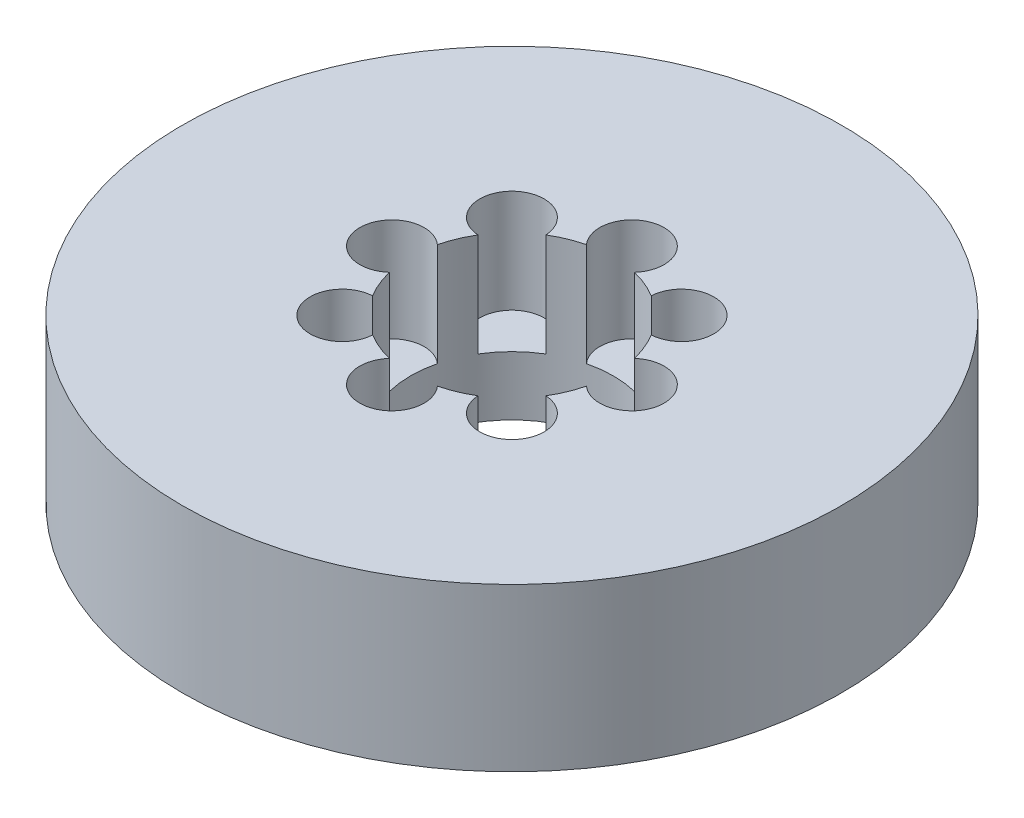
ISO-10303-21;
HEADER;
FILE_DESCRIPTION(('STEP AP214'),'2;1');
FILE_NAME('part.step','',(''),(''),'','','');
FILE_SCHEMA(('AUTOMOTIVE_DESIGN { 1 0 10303 214 1 1 1 1 }'));
ENDSEC;
DATA;
#1=APPLICATION_CONTEXT('core data for automotive mechanical design processes');
#2=APPLICATION_PROTOCOL_DEFINITION('international standard','automotive_design',2000,#1);
#3=PRODUCT_CONTEXT('',#1,'mechanical');
#4=PRODUCT('Part','Part','',(#3));
#5=PRODUCT_RELATED_PRODUCT_CATEGORY('part','',(#4));
#6=PRODUCT_DEFINITION_FORMATION('','',#4);
#7=PRODUCT_DEFINITION_CONTEXT('part definition',#1,'design');
#8=PRODUCT_DEFINITION('design','',#6,#7);
#9=PRODUCT_DEFINITION_SHAPE('','',#8);
#10=(LENGTH_UNIT() NAMED_UNIT(*) SI_UNIT(.MILLI.,.METRE.));
#11=(NAMED_UNIT(*) PLANE_ANGLE_UNIT() SI_UNIT($,.RADIAN.));
#12=(NAMED_UNIT(*) SI_UNIT($,.STERADIAN.) SOLID_ANGLE_UNIT());
#13=UNCERTAINTY_MEASURE_WITH_UNIT(LENGTH_MEASURE(1.E-05),#10,'distance_accuracy_value','');
#14=(GEOMETRIC_REPRESENTATION_CONTEXT(3) GLOBAL_UNCERTAINTY_ASSIGNED_CONTEXT((#13)) GLOBAL_UNIT_ASSIGNED_CONTEXT((#10,
#11,#12)) REPRESENTATION_CONTEXT('',''));
#15=CARTESIAN_POINT('',(0.,0.,0.));
#16=DIRECTION('',(0.,0.,1.));
#17=DIRECTION('',(1.,0.,0.));
#18=AXIS2_PLACEMENT_3D('',#15,#16,#17);
#19=CARTESIAN_POINT('',(0.,16.,0.));
#20=DIRECTION('',(0.,-1.,0.));
#21=DIRECTION('',(0.,0.,-1.));
#22=AXIS2_PLACEMENT_3D('',#19,#20,#21);
#23=CYLINDRICAL_SURFACE('',#22,32.5);
#24=CARTESIAN_POINT('',(0.,16.,0.));
#25=DIRECTION('',(0.,1.,0.));
#26=DIRECTION('',(0.,0.,1.));
#27=AXIS2_PLACEMENT_3D('',#24,#25,#26);
#28=CIRCLE('',#27,32.5);
#29=CARTESIAN_POINT('',(0.,16.,32.5));
#30=VERTEX_POINT('',#29);
#31=EDGE_CURVE('E195',#30,#30,#28,.T.);
#32=ORIENTED_EDGE('',*,*,#31,.F.);
#33=EDGE_LOOP('',(#32));
#34=FACE_BOUND('',#33,.T.);
#35=CARTESIAN_POINT('',(0.,0.,0.));
#36=DIRECTION('',(0.,1.,0.));
#37=DIRECTION('',(0.,0.,1.));
#38=AXIS2_PLACEMENT_3D('',#35,#36,#37);
#39=CIRCLE('',#38,32.5);
#40=CARTESIAN_POINT('',(0.,0.,32.5));
#41=VERTEX_POINT('',#40);
#42=EDGE_CURVE('E179',#41,#41,#39,.T.);
#43=ORIENTED_EDGE('',*,*,#42,.T.);
#44=EDGE_LOOP('',(#43));
#45=FACE_BOUND('',#44,.T.);
#46=ADVANCED_FACE('F39',(#34,#45),#23,.T.);
#47=CARTESIAN_POINT('',(0.,16.,0.));
#48=DIRECTION('',(0.,1.,0.));
#49=DIRECTION('',(0.,0.,1.));
#50=AXIS2_PLACEMENT_3D('',#47,#48,#49);
#51=PLANE('',#50);
#52=CARTESIAN_POINT('',(0.,16.,11.8289437878567));
#53=DIRECTION('',(0.,1.,0.));
#54=DIRECTION('',(1.,0.,0.));
#55=AXIS2_PLACEMENT_3D('',#52,#53,#54);
#56=CIRCLE('',#55,3.1722356472289);
#57=CARTESIAN_POINT('',(-2.36615507002519,16.,9.71603366526661));
#58=VERTEX_POINT('',#57);
#59=CARTESIAN_POINT('',(2.36615507002525,16.,9.71603366526659));
#60=VERTEX_POINT('',#59);
#61=EDGE_CURVE('E176',#58,#60,#56,.T.);
#62=ORIENTED_EDGE('',*,*,#61,.F.);
#63=CARTESIAN_POINT('',(0.,16.,0.));
#64=DIRECTION('',(0.,1.,0.));
#65=DIRECTION('',(0.,0.,1.));
#66=AXIS2_PLACEMENT_3D('',#63,#64,#65);
#67=CIRCLE('',#66,10.);
#68=CARTESIAN_POINT('',(-5.19714899559302,16.,8.54339758630057));
#69=VERTEX_POINT('',#68);
#70=EDGE_CURVE('E166',#69,#58,#67,.T.);
#71=ORIENTED_EDGE('',*,*,#70,.F.);
#72=CARTESIAN_POINT('',(-8.36432636666794,16.,8.36432636666797));
#73=DIRECTION('',(0.,1.,0.));
#74=DIRECTION('',(0.707106781186549,0.,0.707106781186546));
#75=AXIS2_PLACEMENT_3D('',#72,#73,#74);
#76=CIRCLE('',#75,3.1722356472289);
#77=CARTESIAN_POINT('',(-8.54339758630055,16.,5.19714899559305));
#78=VERTEX_POINT('',#77);
#79=EDGE_CURVE('E147',#78,#69,#76,.T.);
#80=ORIENTED_EDGE('',*,*,#79,.F.);
#81=CARTESIAN_POINT('',(-9.7160336652666,16.,2.36615507002522));
#82=VERTEX_POINT('',#81);
#83=EDGE_CURVE('E180',#82,#78,#67,.T.);
#84=ORIENTED_EDGE('',*,*,#83,.F.);
#85=CARTESIAN_POINT('',(-11.8289437878567,16.,0.));
#86=DIRECTION('',(0.,1.,0.));
#87=DIRECTION('',(0.,0.,1.));
#88=AXIS2_PLACEMENT_3D('',#85,#86,#87);
#89=CIRCLE('',#88,3.1722356472289);
#90=CARTESIAN_POINT('',(-9.7160336652666,16.,-2.36615507002522));
#91=VERTEX_POINT('',#90);
#92=EDGE_CURVE('E186',#91,#82,#89,.T.);
#93=ORIENTED_EDGE('',*,*,#92,.F.);
#94=CARTESIAN_POINT('',(-8.54339758630063,16.,-5.19714899559293));
#95=VERTEX_POINT('',#94);
#96=EDGE_CURVE('E182',#95,#91,#67,.T.);
#97=ORIENTED_EDGE('',*,*,#96,.F.);
#98=CARTESIAN_POINT('',(-8.36432636666806,16.,-8.36432636666785));
#99=DIRECTION('',(0.,1.,0.));
#100=DIRECTION('',(-0.707106781186539,0.,0.707106781186556));
#101=AXIS2_PLACEMENT_3D('',#98,#99,#100);
#102=CIRCLE('',#101,3.1722356472289);
#103=CARTESIAN_POINT('',(-5.19714899559314,16.,-8.5433975863005));
#104=VERTEX_POINT('',#103);
#105=EDGE_CURVE('E446',#104,#95,#102,.T.);
#106=ORIENTED_EDGE('',*,*,#105,.F.);
#107=CARTESIAN_POINT('',(-2.36615507002532,16.,-9.71603366526658));
#108=VERTEX_POINT('',#107);
#109=EDGE_CURVE('E452',#108,#104,#67,.T.);
#110=ORIENTED_EDGE('',*,*,#109,.F.);
#111=CARTESIAN_POINT('',(-1.23901609480578E-13,16.,-11.8289437878567));
#112=DIRECTION('',(0.,1.,0.));
#113=DIRECTION('',(-1.,0.,0.));
#114=AXIS2_PLACEMENT_3D('',#111,#112,#113);
#115=CIRCLE('',#114,3.1722356472289);
#116=CARTESIAN_POINT('',(2.36615507002512,16.,-9.71603366526663));
#117=VERTEX_POINT('',#116);
#118=EDGE_CURVE('E477',#117,#108,#115,.T.);
#119=ORIENTED_EDGE('',*,*,#118,.F.);
#120=CARTESIAN_POINT('',(5.19714899559296,16.,-8.54339758630061));
#121=VERTEX_POINT('',#120);
#122=EDGE_CURVE('E460',#121,#117,#67,.T.);
#123=ORIENTED_EDGE('',*,*,#122,.F.);
#124=CARTESIAN_POINT('',(8.36432636666788,16.,-8.36432636666803));
#125=DIRECTION('',(0.,1.,0.));
#126=DIRECTION('',(-0.707106781186554,0.,-0.707106781186541));
#127=AXIS2_PLACEMENT_3D('',#124,#125,#126);
#128=CIRCLE('',#127,3.1722356472289);
#129=CARTESIAN_POINT('',(8.54339758630052,16.,-5.19714899559311));
#130=VERTEX_POINT('',#129);
#131=EDGE_CURVE('E464',#130,#121,#128,.T.);
#132=ORIENTED_EDGE('',*,*,#131,.F.);
#133=CARTESIAN_POINT('',(9.7160336652666,16.,-2.36615507002522));
#134=VERTEX_POINT('',#133);
#135=EDGE_CURVE('E459',#134,#130,#67,.T.);
#136=ORIENTED_EDGE('',*,*,#135,.F.);
#137=CARTESIAN_POINT('',(11.8289437878567,16.,0.));
#138=DIRECTION('',(0.,1.,0.));
#139=DIRECTION('',(0.,0.,-1.));
#140=AXIS2_PLACEMENT_3D('',#137,#138,#139);
#141=CIRCLE('',#140,3.1722356472289);
#142=CARTESIAN_POINT('',(9.7160336652666,16.,2.36615507002522));
#143=VERTEX_POINT('',#142);
#144=EDGE_CURVE('E469',#143,#134,#141,.T.);
#145=ORIENTED_EDGE('',*,*,#144,.F.);
#146=CARTESIAN_POINT('',(8.54339758630059,16.,5.19714899559299));
#147=VERTEX_POINT('',#146);
#148=EDGE_CURVE('E181',#147,#143,#67,.T.);
#149=ORIENTED_EDGE('',*,*,#148,.F.);
#150=CARTESIAN_POINT('',(8.364326366668,16.,8.36432636666791));
#151=DIRECTION('',(0.,1.,0.));
#152=DIRECTION('',(0.707106781186544,0.,-0.707106781186551));
#153=AXIS2_PLACEMENT_3D('',#150,#151,#152);
#154=CIRCLE('',#153,3.1722356472289);
#155=CARTESIAN_POINT('',(5.19714899559308,16.,8.54339758630054));
#156=VERTEX_POINT('',#155);
#157=EDGE_CURVE('E475',#156,#147,#154,.T.);
#158=ORIENTED_EDGE('',*,*,#157,.F.);
#159=EDGE_CURVE('E177',#60,#156,#67,.T.);
#160=ORIENTED_EDGE('',*,*,#159,.F.);
#161=EDGE_LOOP('',(#62,#71,#80,#84,#93,#97,#106,#110,#119,#123,#132,#136,#145,#149,#158,#160));
#162=FACE_BOUND('',#161,.T.);
#163=ORIENTED_EDGE('',*,*,#31,.T.);
#164=EDGE_LOOP('',(#163));
#165=FACE_BOUND('',#164,.T.);
#166=ADVANCED_FACE('F172',(#162,#165),#51,.T.);
#167=CARTESIAN_POINT('',(0.,0.,0.));
#168=DIRECTION('',(0.,1.,0.));
#169=DIRECTION('',(0.,0.,1.));
#170=AXIS2_PLACEMENT_3D('',#167,#168,#169);
#171=PLANE('',#170);
#172=CARTESIAN_POINT('',(0.,0.,0.));
#173=DIRECTION('',(0.,1.,0.));
#174=DIRECTION('',(0.,0.,1.));
#175=AXIS2_PLACEMENT_3D('',#172,#173,#174);
#176=CIRCLE('',#175,10.);
#177=CARTESIAN_POINT('',(0.,0.,10.));
#178=VERTEX_POINT('',#177);
#179=EDGE_CURVE('E187',#178,#178,#176,.T.);
#180=ORIENTED_EDGE('',*,*,#179,.T.);
#181=EDGE_LOOP('',(#180));
#182=FACE_BOUND('',#181,.T.);
#183=ORIENTED_EDGE('',*,*,#42,.F.);
#184=EDGE_LOOP('',(#183));
#185=FACE_BOUND('',#184,.T.);
#186=ADVANCED_FACE('F270',(#182,#185),#171,.F.);
#187=CARTESIAN_POINT('',(0.,16.,0.));
#188=DIRECTION('',(0.,-1.,0.));
#189=DIRECTION('',(0.,0.,-1.));
#190=AXIS2_PLACEMENT_3D('',#187,#188,#189);
#191=CYLINDRICAL_SURFACE('',#190,10.);
#192=DIRECTION('',(0.,1.,0.));
#193=VECTOR('',#192,1.);
#194=CARTESIAN_POINT('',(-2.36615507002519,10.9171696179097,9.71603366526661));
#195=LINE('',#194,#193);
#196=CARTESIAN_POINT('',(-2.36615507002519,5.83433923581949,9.71603366526661));
#197=VERTEX_POINT('',#196);
#198=EDGE_CURVE('E11',#197,#58,#195,.T.);
#199=ORIENTED_EDGE('',*,*,#198,.F.);
#200=CARTESIAN_POINT('',(0.,5.83433923581949,0.));
#201=DIRECTION('',(0.,1.,0.));
#202=DIRECTION('',(0.,0.,1.));
#203=AXIS2_PLACEMENT_3D('',#200,#201,#202);
#204=CIRCLE('',#203,10.);
#205=CARTESIAN_POINT('',(2.36615507002525,5.83433923581949,9.71603366526659));
#206=VERTEX_POINT('',#205);
#207=EDGE_CURVE('E250',#197,#206,#204,.T.);
#208=ORIENTED_EDGE('',*,*,#207,.T.);
#209=DIRECTION('',(0.,1.,0.));
#210=VECTOR('',#209,1.);
#211=CARTESIAN_POINT('',(2.36615507002525,10.9171696179097,9.7160336652666));
#212=LINE('',#211,#210);
#213=EDGE_CURVE('E46',#60,#206,#212,.F.);
#214=ORIENTED_EDGE('',*,*,#213,.F.);
#215=ORIENTED_EDGE('',*,*,#159,.T.);
#216=DIRECTION('',(0.,1.,0.));
#217=VECTOR('',#216,1.);
#218=CARTESIAN_POINT('',(5.19714899559308,10.9171696179097,8.54339758630054));
#219=LINE('',#218,#217);
#220=CARTESIAN_POINT('',(5.19714899559308,5.83433923581949,8.54339758630054));
#221=VERTEX_POINT('',#220);
#222=EDGE_CURVE('E244',#221,#156,#219,.T.);
#223=ORIENTED_EDGE('',*,*,#222,.F.);
#224=CARTESIAN_POINT('',(0.,5.83433923581949,0.));
#225=DIRECTION('',(0.,1.,0.));
#226=DIRECTION('',(0.,0.,1.));
#227=AXIS2_PLACEMENT_3D('',#224,#225,#226);
#228=CIRCLE('',#227,10.);
#229=CARTESIAN_POINT('',(8.54339758630059,5.83433923581949,5.19714899559299));
#230=VERTEX_POINT('',#229);
#231=EDGE_CURVE('E238',#221,#230,#228,.T.);
#232=ORIENTED_EDGE('',*,*,#231,.T.);
#233=DIRECTION('',(0.,1.,0.));
#234=VECTOR('',#233,1.);
#235=CARTESIAN_POINT('',(8.54339758630059,10.9171696179097,5.19714899559299));
#236=LINE('',#235,#234);
#237=EDGE_CURVE('E242',#147,#230,#236,.F.);
#238=ORIENTED_EDGE('',*,*,#237,.F.);
#239=ORIENTED_EDGE('',*,*,#148,.T.);
#240=DIRECTION('',(0.,1.,0.));
#241=VECTOR('',#240,1.);
#242=CARTESIAN_POINT('',(9.7160336652666,10.9171696179097,2.36615507002522));
#243=LINE('',#242,#241);
#244=CARTESIAN_POINT('',(9.7160336652666,5.83433923581949,2.36615507002522));
#245=VERTEX_POINT('',#244);
#246=EDGE_CURVE('E236',#245,#143,#243,.T.);
#247=ORIENTED_EDGE('',*,*,#246,.F.);
#248=CARTESIAN_POINT('',(0.,5.83433923581949,0.));
#249=DIRECTION('',(0.,1.,0.));
#250=DIRECTION('',(0.,0.,1.));
#251=AXIS2_PLACEMENT_3D('',#248,#249,#250);
#252=CIRCLE('',#251,10.);
#253=CARTESIAN_POINT('',(9.7160336652666,5.83433923581949,-2.36615507002522));
#254=VERTEX_POINT('',#253);
#255=EDGE_CURVE('E235',#245,#254,#252,.T.);
#256=ORIENTED_EDGE('',*,*,#255,.T.);
#257=DIRECTION('',(0.,1.,0.));
#258=VECTOR('',#257,1.);
#259=CARTESIAN_POINT('',(9.7160336652666,10.9171696179097,-2.36615507002522));
#260=LINE('',#259,#258);
#261=EDGE_CURVE('E234',#134,#254,#260,.F.);
#262=ORIENTED_EDGE('',*,*,#261,.F.);
#263=ORIENTED_EDGE('',*,*,#135,.T.);
#264=DIRECTION('',(0.,1.,0.));
#265=VECTOR('',#264,1.);
#266=CARTESIAN_POINT('',(8.54339758630052,10.9171696179097,-5.19714899559311));
#267=LINE('',#266,#265);
#268=CARTESIAN_POINT('',(8.54339758630052,5.83433923581949,-5.19714899559311));
#269=VERTEX_POINT('',#268);
#270=EDGE_CURVE('E229',#269,#130,#267,.T.);
#271=ORIENTED_EDGE('',*,*,#270,.F.);
#272=CARTESIAN_POINT('',(0.,5.83433923581949,0.));
#273=DIRECTION('',(0.,1.,0.));
#274=DIRECTION('',(0.,0.,1.));
#275=AXIS2_PLACEMENT_3D('',#272,#273,#274);
#276=CIRCLE('',#275,10.);
#277=CARTESIAN_POINT('',(5.19714899559296,5.83433923581949,-8.54339758630061));
#278=VERTEX_POINT('',#277);
#279=EDGE_CURVE('E221',#269,#278,#276,.T.);
#280=ORIENTED_EDGE('',*,*,#279,.T.);
#281=DIRECTION('',(0.,1.,0.));
#282=VECTOR('',#281,1.);
#283=CARTESIAN_POINT('',(5.19714899559296,10.9171696179097,-8.54339758630061));
#284=LINE('',#283,#282);
#285=EDGE_CURVE('E230',#121,#278,#284,.F.);
#286=ORIENTED_EDGE('',*,*,#285,.F.);
#287=ORIENTED_EDGE('',*,*,#122,.T.);
#288=DIRECTION('',(0.,1.,0.));
#289=VECTOR('',#288,1.);
#290=CARTESIAN_POINT('',(2.36615507002512,10.9171696179097,-9.71603366526663));
#291=LINE('',#290,#289);
#292=CARTESIAN_POINT('',(2.36615507002512,5.83433923581949,-9.71603366526663));
#293=VERTEX_POINT('',#292);
#294=EDGE_CURVE('E225',#293,#117,#291,.T.);
#295=ORIENTED_EDGE('',*,*,#294,.F.);
#296=CARTESIAN_POINT('',(0.,5.83433923581949,0.));
#297=DIRECTION('',(0.,1.,0.));
#298=DIRECTION('',(0.,0.,1.));
#299=AXIS2_PLACEMENT_3D('',#296,#297,#298);
#300=CIRCLE('',#299,10.);
#301=CARTESIAN_POINT('',(-2.36615507002532,5.83433923581949,-9.71603366526658));
#302=VERTEX_POINT('',#301);
#303=EDGE_CURVE('E216',#293,#302,#300,.T.);
#304=ORIENTED_EDGE('',*,*,#303,.T.);
#305=DIRECTION('',(0.,1.,0.));
#306=VECTOR('',#305,1.);
#307=CARTESIAN_POINT('',(-2.36615507002532,10.9171696179097,-9.71603366526658));
#308=LINE('',#307,#306);
#309=EDGE_CURVE('E218',#108,#302,#308,.F.);
#310=ORIENTED_EDGE('',*,*,#309,.F.);
#311=ORIENTED_EDGE('',*,*,#109,.T.);
#312=DIRECTION('',(0.,1.,0.));
#313=VECTOR('',#312,1.);
#314=CARTESIAN_POINT('',(-5.19714899559314,10.9171696179097,-8.5433975863005));
#315=LINE('',#314,#313);
#316=CARTESIAN_POINT('',(-5.19714899559314,5.83433923581949,-8.5433975863005));
#317=VERTEX_POINT('',#316);
#318=EDGE_CURVE('E212',#317,#104,#315,.T.);
#319=ORIENTED_EDGE('',*,*,#318,.F.);
#320=CARTESIAN_POINT('',(0.,5.83433923581949,0.));
#321=DIRECTION('',(0.,1.,0.));
#322=DIRECTION('',(0.,0.,1.));
#323=AXIS2_PLACEMENT_3D('',#320,#321,#322);
#324=CIRCLE('',#323,10.);
#325=CARTESIAN_POINT('',(-8.54339758630063,5.83433923581949,-5.19714899559293));
#326=VERTEX_POINT('',#325);
#327=EDGE_CURVE('E208',#317,#326,#324,.T.);
#328=ORIENTED_EDGE('',*,*,#327,.T.);
#329=DIRECTION('',(0.,1.,0.));
#330=VECTOR('',#329,1.);
#331=CARTESIAN_POINT('',(-8.54339758630063,10.9171696179097,-5.19714899559293));
#332=LINE('',#331,#330);
#333=EDGE_CURVE('E211',#95,#326,#332,.F.);
#334=ORIENTED_EDGE('',*,*,#333,.F.);
#335=ORIENTED_EDGE('',*,*,#96,.T.);
#336=DIRECTION('',(0.,1.,0.));
#337=VECTOR('',#336,1.);
#338=CARTESIAN_POINT('',(-9.7160336652666,10.9171696179097,-2.36615507002522));
#339=LINE('',#338,#337);
#340=CARTESIAN_POINT('',(-9.7160336652666,5.83433923581949,-2.36615507002522));
#341=VERTEX_POINT('',#340);
#342=EDGE_CURVE('E201',#341,#91,#339,.T.);
#343=ORIENTED_EDGE('',*,*,#342,.F.);
#344=CARTESIAN_POINT('',(0.,5.83433923581949,0.));
#345=DIRECTION('',(0.,1.,0.));
#346=DIRECTION('',(0.,0.,1.));
#347=AXIS2_PLACEMENT_3D('',#344,#345,#346);
#348=CIRCLE('',#347,10.);
#349=CARTESIAN_POINT('',(-9.7160336652666,5.83433923581949,2.36615507002522));
#350=VERTEX_POINT('',#349);
#351=EDGE_CURVE('E194',#341,#350,#348,.T.);
#352=ORIENTED_EDGE('',*,*,#351,.T.);
#353=DIRECTION('',(0.,1.,0.));
#354=VECTOR('',#353,1.);
#355=CARTESIAN_POINT('',(-9.7160336652666,10.9171696179097,2.36615507002522));
#356=LINE('',#355,#354);
#357=EDGE_CURVE('E199',#82,#350,#356,.F.);
#358=ORIENTED_EDGE('',*,*,#357,.F.);
#359=ORIENTED_EDGE('',*,*,#83,.T.);
#360=DIRECTION('',(0.,1.,0.));
#361=VECTOR('',#360,1.);
#362=CARTESIAN_POINT('',(-8.54339758630055,10.9171696179097,5.19714899559305));
#363=LINE('',#362,#361);
#364=CARTESIAN_POINT('',(-8.54339758630055,5.83433923581949,5.19714899559305));
#365=VERTEX_POINT('',#364);
#366=EDGE_CURVE('E160',#365,#78,#363,.T.);
#367=ORIENTED_EDGE('',*,*,#366,.F.);
#368=CARTESIAN_POINT('',(0.,5.83433923581949,0.));
#369=DIRECTION('',(0.,1.,0.));
#370=DIRECTION('',(0.,0.,1.));
#371=AXIS2_PLACEMENT_3D('',#368,#369,#370);
#372=CIRCLE('',#371,10.);
#373=CARTESIAN_POINT('',(-5.19714899559302,5.83433923581949,8.54339758630057));
#374=VERTEX_POINT('',#373);
#375=EDGE_CURVE('E168',#365,#374,#372,.T.);
#376=ORIENTED_EDGE('',*,*,#375,.T.);
#377=DIRECTION('',(0.,1.,0.));
#378=VECTOR('',#377,1.);
#379=CARTESIAN_POINT('',(-5.19714899559302,10.9171696179097,8.54339758630057));
#380=LINE('',#379,#378);
#381=EDGE_CURVE('E152',#69,#374,#380,.F.);
#382=ORIENTED_EDGE('',*,*,#381,.F.);
#383=ORIENTED_EDGE('',*,*,#70,.T.);
#384=EDGE_LOOP('',(#199,#208,#214,#215,#223,#232,#238,#239,#247,#256,#262,#263,#271,#280,#286,
#287,#295,#304,#310,#311,#319,#328,#334,#335,#343,#352,#358,#359,#367,#376,#382,#383));
#385=FACE_BOUND('',#384,.T.);
#386=ORIENTED_EDGE('',*,*,#179,.F.);
#387=EDGE_LOOP('',(#386));
#388=FACE_BOUND('',#387,.T.);
#389=ADVANCED_FACE('F170',(#385,#388),#191,.F.);
#390=CARTESIAN_POINT('',(-11.8289437878567,5.83433923581949,0.));
#391=DIRECTION('',(0.,1.,0.));
#392=DIRECTION('',(0.,0.,1.));
#393=AXIS2_PLACEMENT_3D('',#390,#391,#392);
#394=CYLINDRICAL_SURFACE('',#393,3.1722356472289);
#395=ORIENTED_EDGE('',*,*,#342,.T.);
#396=ORIENTED_EDGE('',*,*,#92,.T.);
#397=ORIENTED_EDGE('',*,*,#357,.T.);
#398=CARTESIAN_POINT('',(-11.8289437878567,5.83433923581949,0.));
#399=DIRECTION('',(0.,1.,0.));
#400=DIRECTION('',(0.,0.,1.));
#401=AXIS2_PLACEMENT_3D('',#398,#399,#400);
#402=CIRCLE('',#401,3.1722356472289);
#403=EDGE_CURVE('E191',#341,#350,#402,.T.);
#404=ORIENTED_EDGE('',*,*,#403,.F.);
#405=EDGE_LOOP('',(#395,#396,#397,#404));
#406=FACE_BOUND('',#405,.T.);
#407=ADVANCED_FACE('F279',(#406),#394,.F.);
#408=CARTESIAN_POINT('',(-11.8289437878567,5.83433923581949,0.));
#409=DIRECTION('',(0.,1.,0.));
#410=DIRECTION('',(0.,0.,1.));
#411=AXIS2_PLACEMENT_3D('',#408,#409,#410);
#412=PLANE('',#411);
#413=ORIENTED_EDGE('',*,*,#403,.T.);
#414=ORIENTED_EDGE('',*,*,#351,.F.);
#415=EDGE_LOOP('',(#413,#414));
#416=FACE_BOUND('',#415,.T.);
#417=ADVANCED_FACE('F285',(#416),#412,.T.);
#418=CARTESIAN_POINT('',(-8.36432636666794,5.83433923581949,8.36432636666797));
#419=DIRECTION('',(0.,1.,0.));
#420=DIRECTION('',(0.,0.,1.));
#421=AXIS2_PLACEMENT_3D('',#418,#419,#420);
#422=CYLINDRICAL_SURFACE('',#421,3.1722356472289);
#423=ORIENTED_EDGE('',*,*,#366,.T.);
#424=ORIENTED_EDGE('',*,*,#79,.T.);
#425=ORIENTED_EDGE('',*,*,#381,.T.);
#426=CARTESIAN_POINT('',(-8.36432636666794,5.83433923581949,8.36432636666797));
#427=DIRECTION('',(0.,1.,0.));
#428=DIRECTION('',(0.707106781186549,0.,0.707106781186546));
#429=AXIS2_PLACEMENT_3D('',#426,#427,#428);
#430=CIRCLE('',#429,3.1722356472289);
#431=EDGE_CURVE('E165',#365,#374,#430,.T.);
#432=ORIENTED_EDGE('',*,*,#431,.F.);
#433=EDGE_LOOP('',(#423,#424,#425,#432));
#434=FACE_BOUND('',#433,.T.);
#435=ADVANCED_FACE('F155',(#434),#422,.F.);
#436=CARTESIAN_POINT('',(-8.36432636666794,5.83433923581949,8.36432636666797));
#437=DIRECTION('',(0.,1.,0.));
#438=DIRECTION('',(0.707106781186549,0.,0.707106781186546));
#439=AXIS2_PLACEMENT_3D('',#436,#437,#438);
#440=PLANE('',#439);
#441=ORIENTED_EDGE('',*,*,#431,.T.);
#442=ORIENTED_EDGE('',*,*,#375,.F.);
#443=EDGE_LOOP('',(#441,#442));
#444=FACE_BOUND('',#443,.T.);
#445=ADVANCED_FACE('F288',(#444),#440,.T.);
#446=CARTESIAN_POINT('',(-8.36432636666806,5.83433923581949,-8.36432636666785));
#447=DIRECTION('',(0.,1.,0.));
#448=DIRECTION('',(0.,0.,1.));
#449=AXIS2_PLACEMENT_3D('',#446,#447,#448);
#450=CYLINDRICAL_SURFACE('',#449,3.1722356472289);
#451=ORIENTED_EDGE('',*,*,#318,.T.);
#452=ORIENTED_EDGE('',*,*,#105,.T.);
#453=ORIENTED_EDGE('',*,*,#333,.T.);
#454=CARTESIAN_POINT('',(-8.36432636666806,5.83433923581949,-8.36432636666785));
#455=DIRECTION('',(0.,1.,0.));
#456=DIRECTION('',(-0.707106781186539,0.,0.707106781186556));
#457=AXIS2_PLACEMENT_3D('',#454,#455,#456);
#458=CIRCLE('',#457,3.1722356472289);
#459=EDGE_CURVE('E447',#317,#326,#458,.T.);
#460=ORIENTED_EDGE('',*,*,#459,.F.);
#461=EDGE_LOOP('',(#451,#452,#453,#460));
#462=FACE_BOUND('',#461,.T.);
#463=ADVANCED_FACE('F295',(#462),#450,.F.);
#464=CARTESIAN_POINT('',(-8.36432636666806,5.83433923581949,-8.36432636666785));
#465=DIRECTION('',(0.,1.,0.));
#466=DIRECTION('',(-0.707106781186539,0.,0.707106781186556));
#467=AXIS2_PLACEMENT_3D('',#464,#465,#466);
#468=PLANE('',#467);
#469=ORIENTED_EDGE('',*,*,#459,.T.);
#470=ORIENTED_EDGE('',*,*,#327,.F.);
#471=EDGE_LOOP('',(#469,#470));
#472=FACE_BOUND('',#471,.T.);
#473=ADVANCED_FACE('F375',(#472),#468,.T.);
#474=CARTESIAN_POINT('',(-1.23901609480578E-13,5.83433923581949,-11.8289437878567));
#475=DIRECTION('',(0.,1.,0.));
#476=DIRECTION('',(0.,0.,1.));
#477=AXIS2_PLACEMENT_3D('',#474,#475,#476);
#478=CYLINDRICAL_SURFACE('',#477,3.1722356472289);
#479=ORIENTED_EDGE('',*,*,#294,.T.);
#480=ORIENTED_EDGE('',*,*,#118,.T.);
#481=ORIENTED_EDGE('',*,*,#309,.T.);
#482=CARTESIAN_POINT('',(-1.23901609480578E-13,5.83433923581949,-11.8289437878567));
#483=DIRECTION('',(0.,1.,0.));
#484=DIRECTION('',(-1.,0.,0.));
#485=AXIS2_PLACEMENT_3D('',#482,#483,#484);
#486=CIRCLE('',#485,3.1722356472289);
#487=EDGE_CURVE('E467',#293,#302,#486,.T.);
#488=ORIENTED_EDGE('',*,*,#487,.F.);
#489=EDGE_LOOP('',(#479,#480,#481,#488));
#490=FACE_BOUND('',#489,.T.);
#491=ADVANCED_FACE('F361',(#490),#478,.F.);
#492=CARTESIAN_POINT('',(-1.23901609480578E-13,5.83433923581949,-11.8289437878567));
#493=DIRECTION('',(0.,1.,0.));
#494=DIRECTION('',(-1.,0.,0.));
#495=AXIS2_PLACEMENT_3D('',#492,#493,#494);
#496=PLANE('',#495);
#497=ORIENTED_EDGE('',*,*,#487,.T.);
#498=ORIENTED_EDGE('',*,*,#303,.F.);
#499=EDGE_LOOP('',(#497,#498));
#500=FACE_BOUND('',#499,.T.);
#501=ADVANCED_FACE('F297',(#500),#496,.T.);
#502=CARTESIAN_POINT('',(8.36432636666788,5.83433923581949,-8.36432636666803));
#503=DIRECTION('',(0.,1.,0.));
#504=DIRECTION('',(0.,0.,1.));
#505=AXIS2_PLACEMENT_3D('',#502,#503,#504);
#506=CYLINDRICAL_SURFACE('',#505,3.1722356472289);
#507=ORIENTED_EDGE('',*,*,#270,.T.);
#508=ORIENTED_EDGE('',*,*,#131,.T.);
#509=ORIENTED_EDGE('',*,*,#285,.T.);
#510=CARTESIAN_POINT('',(8.36432636666788,5.83433923581949,-8.36432636666803));
#511=DIRECTION('',(0.,1.,0.));
#512=DIRECTION('',(-0.707106781186554,0.,-0.707106781186541));
#513=AXIS2_PLACEMENT_3D('',#510,#511,#512);
#514=CIRCLE('',#513,3.1722356472289);
#515=EDGE_CURVE('E470',#269,#278,#514,.T.);
#516=ORIENTED_EDGE('',*,*,#515,.F.);
#517=EDGE_LOOP('',(#507,#508,#509,#516));
#518=FACE_BOUND('',#517,.T.);
#519=ADVANCED_FACE('F294',(#518),#506,.F.);
#520=CARTESIAN_POINT('',(8.36432636666788,5.83433923581949,-8.36432636666803));
#521=DIRECTION('',(0.,1.,0.));
#522=DIRECTION('',(-0.707106781186554,0.,-0.707106781186541));
#523=AXIS2_PLACEMENT_3D('',#520,#521,#522);
#524=PLANE('',#523);
#525=ORIENTED_EDGE('',*,*,#515,.T.);
#526=ORIENTED_EDGE('',*,*,#279,.F.);
#527=EDGE_LOOP('',(#525,#526));
#528=FACE_BOUND('',#527,.T.);
#529=ADVANCED_FACE('F300',(#528),#524,.T.);
#530=CARTESIAN_POINT('',(11.8289437878567,5.83433923581949,0.));
#531=DIRECTION('',(0.,1.,0.));
#532=DIRECTION('',(0.,0.,1.));
#533=AXIS2_PLACEMENT_3D('',#530,#531,#532);
#534=CYLINDRICAL_SURFACE('',#533,3.1722356472289);
#535=ORIENTED_EDGE('',*,*,#246,.T.);
#536=ORIENTED_EDGE('',*,*,#144,.T.);
#537=ORIENTED_EDGE('',*,*,#261,.T.);
#538=CARTESIAN_POINT('',(11.8289437878567,5.83433923581949,0.));
#539=DIRECTION('',(0.,1.,0.));
#540=DIRECTION('',(0.,0.,-1.));
#541=AXIS2_PLACEMENT_3D('',#538,#539,#540);
#542=CIRCLE('',#541,3.1722356472289);
#543=EDGE_CURVE('E472',#245,#254,#542,.T.);
#544=ORIENTED_EDGE('',*,*,#543,.F.);
#545=EDGE_LOOP('',(#535,#536,#537,#544));
#546=FACE_BOUND('',#545,.T.);
#547=ADVANCED_FACE('F305',(#546),#534,.F.);
#548=CARTESIAN_POINT('',(11.8289437878567,5.83433923581949,0.));
#549=DIRECTION('',(0.,1.,0.));
#550=DIRECTION('',(0.,0.,-1.));
#551=AXIS2_PLACEMENT_3D('',#548,#549,#550);
#552=PLANE('',#551);
#553=ORIENTED_EDGE('',*,*,#543,.T.);
#554=ORIENTED_EDGE('',*,*,#255,.F.);
#555=EDGE_LOOP('',(#553,#554));
#556=FACE_BOUND('',#555,.T.);
#557=ADVANCED_FACE('F308',(#556),#552,.T.);
#558=CARTESIAN_POINT('',(8.364326366668,5.83433923581949,8.36432636666791));
#559=DIRECTION('',(0.,1.,0.));
#560=DIRECTION('',(0.,0.,1.));
#561=AXIS2_PLACEMENT_3D('',#558,#559,#560);
#562=CYLINDRICAL_SURFACE('',#561,3.1722356472289);
#563=ORIENTED_EDGE('',*,*,#222,.T.);
#564=ORIENTED_EDGE('',*,*,#157,.T.);
#565=ORIENTED_EDGE('',*,*,#237,.T.);
#566=CARTESIAN_POINT('',(8.364326366668,5.83433923581949,8.36432636666791));
#567=DIRECTION('',(0.,1.,0.));
#568=DIRECTION('',(0.707106781186544,0.,-0.707106781186551));
#569=AXIS2_PLACEMENT_3D('',#566,#567,#568);
#570=CIRCLE('',#569,3.1722356472289);
#571=EDGE_CURVE('E56',#221,#230,#570,.T.);
#572=ORIENTED_EDGE('',*,*,#571,.F.);
#573=EDGE_LOOP('',(#563,#564,#565,#572));
#574=FACE_BOUND('',#573,.T.);
#575=ADVANCED_FACE('F309',(#574),#562,.F.);
#576=CARTESIAN_POINT('',(8.364326366668,5.83433923581949,8.36432636666791));
#577=DIRECTION('',(0.,1.,0.));
#578=DIRECTION('',(0.707106781186544,0.,-0.707106781186551));
#579=AXIS2_PLACEMENT_3D('',#576,#577,#578);
#580=PLANE('',#579);
#581=ORIENTED_EDGE('',*,*,#571,.T.);
#582=ORIENTED_EDGE('',*,*,#231,.F.);
#583=EDGE_LOOP('',(#581,#582));
#584=FACE_BOUND('',#583,.T.);
#585=ADVANCED_FACE('F256',(#584),#580,.T.);
#586=CARTESIAN_POINT('',(0.,5.83433923581949,11.8289437878567));
#587=DIRECTION('',(0.,1.,0.));
#588=DIRECTION('',(0.,0.,1.));
#589=AXIS2_PLACEMENT_3D('',#586,#587,#588);
#590=CYLINDRICAL_SURFACE('',#589,3.1722356472289);
#591=ORIENTED_EDGE('',*,*,#198,.T.);
#592=ORIENTED_EDGE('',*,*,#61,.T.);
#593=ORIENTED_EDGE('',*,*,#213,.T.);
#594=CARTESIAN_POINT('',(0.,5.83433923581949,11.8289437878567));
#595=DIRECTION('',(0.,1.,0.));
#596=DIRECTION('',(1.,0.,0.));
#597=AXIS2_PLACEMENT_3D('',#594,#595,#596);
#598=CIRCLE('',#597,3.1722356472289);
#599=EDGE_CURVE('E55',#197,#206,#598,.T.);
#600=ORIENTED_EDGE('',*,*,#599,.F.);
#601=EDGE_LOOP('',(#591,#592,#593,#600));
#602=FACE_BOUND('',#601,.T.);
#603=ADVANCED_FACE('F253',(#602),#590,.F.);
#604=CARTESIAN_POINT('',(0.,5.83433923581949,11.8289437878567));
#605=DIRECTION('',(0.,1.,0.));
#606=DIRECTION('',(1.,0.,0.));
#607=AXIS2_PLACEMENT_3D('',#604,#605,#606);
#608=PLANE('',#607);
#609=ORIENTED_EDGE('',*,*,#599,.T.);
#610=ORIENTED_EDGE('',*,*,#207,.F.);
#611=EDGE_LOOP('',(#609,#610));
#612=FACE_BOUND('',#611,.T.);
#613=ADVANCED_FACE('F252',(#612),#608,.T.);
#614=CLOSED_SHELL('',(#46,#166,#186,#389,#407,#417,#435,#445,#463,#473,#491,#501,#519,#529,#547,
#557,#575,#585,#603,#613));
#615=MANIFOLD_SOLID_BREP('B2',#614);
#616=ADVANCED_BREP_SHAPE_REPRESENTATION('',(#18,#615),#14);
#617=SHAPE_DEFINITION_REPRESENTATION(#9,#616);
ENDSEC;
END-ISO-10303-21;
